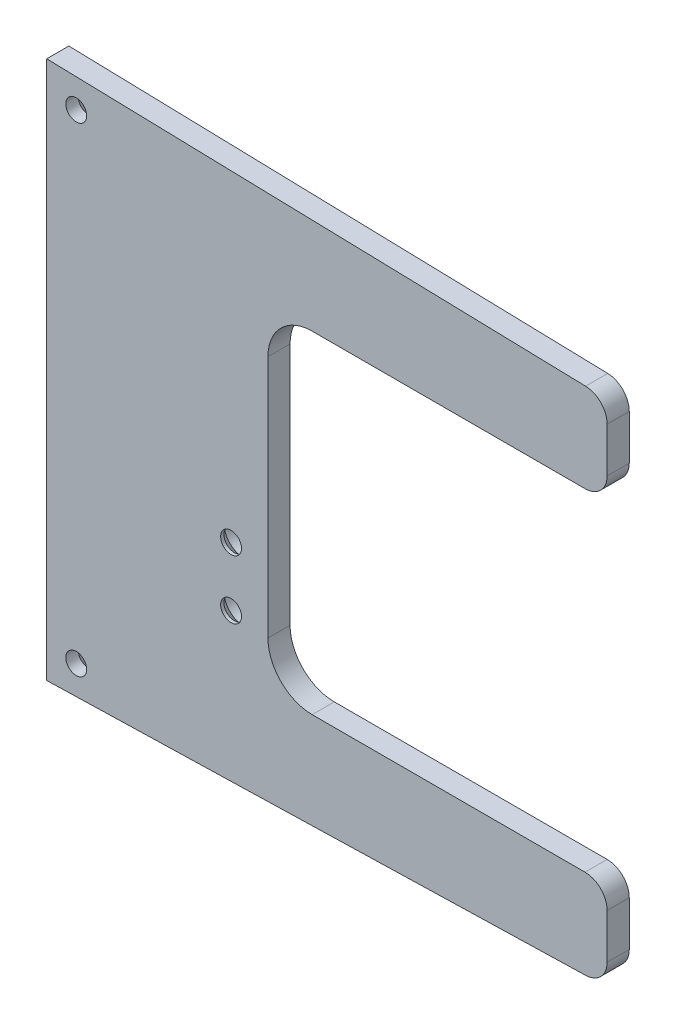
ISO-10303-21;
HEADER;
FILE_DESCRIPTION(('STEP AP214'),'2;1');
FILE_NAME('part.step','',(''),(''),'','','');
FILE_SCHEMA(('AUTOMOTIVE_DESIGN { 1 0 10303 214 1 1 1 1 }'));
ENDSEC;
DATA;
#1=APPLICATION_CONTEXT('core data for automotive mechanical design processes');
#2=APPLICATION_PROTOCOL_DEFINITION('international standard','automotive_design',2000,#1);
#3=PRODUCT_CONTEXT('',#1,'mechanical');
#4=PRODUCT('Part','Part','',(#3));
#5=PRODUCT_RELATED_PRODUCT_CATEGORY('part','',(#4));
#6=PRODUCT_DEFINITION_FORMATION('','',#4);
#7=PRODUCT_DEFINITION_CONTEXT('part definition',#1,'design');
#8=PRODUCT_DEFINITION('design','',#6,#7);
#9=PRODUCT_DEFINITION_SHAPE('','',#8);
#10=(LENGTH_UNIT() NAMED_UNIT(*) SI_UNIT(.MILLI.,.METRE.));
#11=(NAMED_UNIT(*) PLANE_ANGLE_UNIT() SI_UNIT($,.RADIAN.));
#12=(NAMED_UNIT(*) SI_UNIT($,.STERADIAN.) SOLID_ANGLE_UNIT());
#13=UNCERTAINTY_MEASURE_WITH_UNIT(LENGTH_MEASURE(1.E-05),#10,'distance_accuracy_value','');
#14=(GEOMETRIC_REPRESENTATION_CONTEXT(3) GLOBAL_UNCERTAINTY_ASSIGNED_CONTEXT((#13)) GLOBAL_UNIT_ASSIGNED_CONTEXT((#10,
#11,#12)) REPRESENTATION_CONTEXT('',''));
#15=CARTESIAN_POINT('',(0.,0.,0.));
#16=DIRECTION('',(0.,0.,1.));
#17=DIRECTION('',(1.,0.,0.));
#18=AXIS2_PLACEMENT_3D('',#15,#16,#17);
#19=CARTESIAN_POINT('',(-47.625,115.91925,-9.525));
#20=DIRECTION('',(1.,0.,0.));
#21=DIRECTION('',(0.,1.,0.));
#22=AXIS2_PLACEMENT_3D('',#19,#20,#21);
#23=PLANE('',#22);
#24=DIRECTION('',(0.,-1.,0.));
#25=VECTOR('',#24,1.);
#26=CARTESIAN_POINT('',(-47.625,115.91925,0.));
#27=LINE('',#26,#25);
#28=CARTESIAN_POINT('',(-47.625,115.91925,0.));
#29=VERTEX_POINT('',#28);
#30=CARTESIAN_POINT('',(-47.625,-115.91925,0.));
#31=VERTEX_POINT('',#30);
#32=EDGE_CURVE('E167',#29,#31,#27,.T.);
#33=ORIENTED_EDGE('',*,*,#32,.F.);
#34=DIRECTION('',(0.,0.,1.));
#35=VECTOR('',#34,1.);
#36=CARTESIAN_POINT('',(-47.625,115.91925,-9.525));
#37=LINE('',#36,#35);
#38=CARTESIAN_POINT('',(-47.625,115.91925,-9.525));
#39=VERTEX_POINT('',#38);
#40=EDGE_CURVE('E158',#39,#29,#37,.T.);
#41=ORIENTED_EDGE('',*,*,#40,.F.);
#42=DIRECTION('',(0.,-1.,0.));
#43=VECTOR('',#42,1.);
#44=CARTESIAN_POINT('',(-47.625,115.91925,-9.525));
#45=LINE('',#44,#43);
#46=CARTESIAN_POINT('',(-47.625,-115.91925,-9.525));
#47=VERTEX_POINT('',#46);
#48=EDGE_CURVE('E141',#39,#47,#45,.T.);
#49=ORIENTED_EDGE('',*,*,#48,.T.);
#50=DIRECTION('',(0.,0.,1.));
#51=VECTOR('',#50,1.);
#52=CARTESIAN_POINT('',(-47.625,-115.91925,-9.525));
#53=LINE('',#52,#51);
#54=EDGE_CURVE('E151',#47,#31,#53,.T.);
#55=ORIENTED_EDGE('',*,*,#54,.T.);
#56=EDGE_LOOP('',(#33,#41,#49,#55));
#57=FACE_BOUND('',#56,.T.);
#58=ADVANCED_FACE('F36',(#57),#23,.F.);
#59=CARTESIAN_POINT('',(47.625,115.91925,-9.525));
#60=DIRECTION('',(-1.,0.,0.));
#61=DIRECTION('',(0.,-1.,0.));
#62=AXIS2_PLACEMENT_3D('',#59,#60,#61);
#63=PLANE('',#62);
#64=DIRECTION('',(0.,1.,0.));
#65=VECTOR('',#64,1.);
#66=CARTESIAN_POINT('',(47.625,115.91925,-9.525));
#67=LINE('',#66,#65);
#68=CARTESIAN_POINT('',(47.625,-52.4505871253568,-9.525));
#69=VERTEX_POINT('',#68);
#70=CARTESIAN_POINT('',(47.625,52.4505871253569,-9.525));
#71=VERTEX_POINT('',#70);
#72=EDGE_CURVE('E161',#69,#71,#67,.T.);
#73=ORIENTED_EDGE('',*,*,#72,.T.);
#74=DIRECTION('',(0.,0.,-1.));
#75=VECTOR('',#74,1.);
#76=CARTESIAN_POINT('',(47.625,52.4505871253569,-9.525));
#77=LINE('',#76,#75);
#78=CARTESIAN_POINT('',(47.625,52.4505871253569,0.));
#79=VERTEX_POINT('',#78);
#80=EDGE_CURVE('E214',#79,#71,#77,.T.);
#81=ORIENTED_EDGE('',*,*,#80,.F.);
#82=DIRECTION('',(0.,1.,0.));
#83=VECTOR('',#82,1.);
#84=CARTESIAN_POINT('',(47.625,115.91925,0.));
#85=LINE('',#84,#83);
#86=CARTESIAN_POINT('',(47.625,-52.4505871253568,0.));
#87=VERTEX_POINT('',#86);
#88=EDGE_CURVE('E162',#87,#79,#85,.T.);
#89=ORIENTED_EDGE('',*,*,#88,.F.);
#90=DIRECTION('',(0.,0.,-1.));
#91=VECTOR('',#90,1.);
#92=CARTESIAN_POINT('',(47.625,-52.4505871253569,-9.525));
#93=LINE('',#92,#91);
#94=EDGE_CURVE('E217',#69,#87,#93,.F.);
#95=ORIENTED_EDGE('',*,*,#94,.F.);
#96=EDGE_LOOP('',(#73,#81,#89,#95));
#97=FACE_BOUND('',#96,.T.);
#98=ADVANCED_FACE('F308',(#97),#63,.F.);
#99=CARTESIAN_POINT('',(-47.625,-115.91925,-9.525));
#100=DIRECTION('',(0.,0.,-1.));
#101=DIRECTION('',(1.,0.,0.));
#102=AXIS2_PLACEMENT_3D('',#99,#100,#101);
#103=PLANE('',#102);
#104=DIRECTION('',(-0.999657324975558,-0.0261769483078661,0.));
#105=VECTOR('',#104,1.);
#106=CARTESIAN_POINT('',(47.625,-113.425040970536,-9.525));
#107=LINE('',#106,#105);
#108=CARTESIAN_POINT('',(184.399335432632,-109.84347895022,-9.525));
#109=VERTEX_POINT('',#108);
#110=EDGE_CURVE('E135',#109,#47,#107,.T.);
#111=ORIENTED_EDGE('',*,*,#110,.T.);
#112=ORIENTED_EDGE('',*,*,#48,.F.);
#113=DIRECTION('',(0.999657324975557,-0.026176948307866,0.));
#114=VECTOR('',#113,1.);
#115=CARTESIAN_POINT('',(-47.625,115.91925,-9.525));
#116=LINE('',#115,#114);
#117=CARTESIAN_POINT('',(184.399335432632,109.84347895022,-9.525));
#118=VERTEX_POINT('',#117);
#119=EDGE_CURVE('E147',#39,#118,#116,.T.);
#120=ORIENTED_EDGE('',*,*,#119,.T.);
#121=CARTESIAN_POINT('',(184.15,100.321742929828,-9.52500000000001));
#122=DIRECTION('',(0.,0.,1.));
#123=DIRECTION('',(1.,0.,0.));
#124=AXIS2_PLACEMENT_3D('',#121,#122,#123);
#125=CIRCLE('',#124,9.525);
#126=CARTESIAN_POINT('',(193.675,100.321742929828,-9.525));
#127=VERTEX_POINT('',#126);
#128=EDGE_CURVE('E176',#127,#118,#125,.T.);
#129=ORIENTED_EDGE('',*,*,#128,.F.);
#130=DIRECTION('',(0.,1.,0.));
#131=VECTOR('',#130,1.);
#132=CARTESIAN_POINT('',(193.675,109.600587125357,-9.525));
#133=LINE('',#132,#131);
#134=CARTESIAN_POINT('',(193.675,81.0255871253569,-9.525));
#135=VERTEX_POINT('',#134);
#136=EDGE_CURVE('E231',#135,#127,#133,.T.);
#137=ORIENTED_EDGE('',*,*,#136,.F.);
#138=CARTESIAN_POINT('',(184.15,81.0255871253569,-9.52500000000001));
#139=DIRECTION('',(0.,0.,1.));
#140=DIRECTION('',(1.,0.,0.));
#141=AXIS2_PLACEMENT_3D('',#138,#139,#140);
#142=CIRCLE('',#141,9.525);
#143=CARTESIAN_POINT('',(184.15,71.5005871253569,-9.525));
#144=VERTEX_POINT('',#143);
#145=EDGE_CURVE('E179',#144,#135,#142,.T.);
#146=ORIENTED_EDGE('',*,*,#145,.F.);
#147=DIRECTION('',(1.,0.,0.));
#148=VECTOR('',#147,1.);
#149=CARTESIAN_POINT('',(193.675,71.5005871253569,-9.525));
#150=LINE('',#149,#148);
#151=CARTESIAN_POINT('',(66.675,71.5005871253569,-9.525));
#152=VERTEX_POINT('',#151);
#153=EDGE_CURVE('E229',#152,#144,#150,.T.);
#154=ORIENTED_EDGE('',*,*,#153,.F.);
#155=CARTESIAN_POINT('',(66.675,52.4505871253569,-9.525));
#156=DIRECTION('',(0.,0.,1.));
#157=DIRECTION('',(1.,0.,0.));
#158=AXIS2_PLACEMENT_3D('',#155,#156,#157);
#159=CIRCLE('',#158,19.05);
#160=EDGE_CURVE('E44',#71,#152,#159,.F.);
#161=ORIENTED_EDGE('',*,*,#160,.F.);
#162=ORIENTED_EDGE('',*,*,#72,.F.);
#163=CARTESIAN_POINT('',(66.675,-52.4505871253569,-9.52500000000001));
#164=DIRECTION('',(0.,0.,1.));
#165=DIRECTION('',(1.,0.,0.));
#166=AXIS2_PLACEMENT_3D('',#163,#164,#165);
#167=CIRCLE('',#166,19.05);
#168=CARTESIAN_POINT('',(66.675,-71.5005871253569,-9.525));
#169=VERTEX_POINT('',#168);
#170=EDGE_CURVE('E221',#169,#69,#167,.F.);
#171=ORIENTED_EDGE('',*,*,#170,.F.);
#172=DIRECTION('',(-1.,0.,0.));
#173=VECTOR('',#172,1.);
#174=CARTESIAN_POINT('',(47.625,-71.5005871253569,-9.525));
#175=LINE('',#174,#173);
#176=CARTESIAN_POINT('',(184.15,-71.5005871253569,-9.525));
#177=VERTEX_POINT('',#176);
#178=EDGE_CURVE('E348',#177,#169,#175,.T.);
#179=ORIENTED_EDGE('',*,*,#178,.F.);
#180=CARTESIAN_POINT('',(184.15,-81.0255871253569,-9.52500000000001));
#181=DIRECTION('',(0.,0.,1.));
#182=DIRECTION('',(1.,0.,0.));
#183=AXIS2_PLACEMENT_3D('',#180,#181,#182);
#184=CIRCLE('',#183,9.525);
#185=CARTESIAN_POINT('',(193.675,-81.0255871253569,-9.525));
#186=VERTEX_POINT('',#185);
#187=EDGE_CURVE('E182',#186,#177,#184,.T.);
#188=ORIENTED_EDGE('',*,*,#187,.F.);
#189=DIRECTION('',(0.,1.,0.));
#190=VECTOR('',#189,1.);
#191=CARTESIAN_POINT('',(193.675,-71.5005871253569,-9.525));
#192=LINE('',#191,#190);
#193=CARTESIAN_POINT('',(193.675,-100.321742929828,-9.525));
#194=VERTEX_POINT('',#193);
#195=EDGE_CURVE('E351',#194,#186,#192,.T.);
#196=ORIENTED_EDGE('',*,*,#195,.F.);
#197=CARTESIAN_POINT('',(184.15,-100.321742929828,-9.525));
#198=DIRECTION('',(0.,0.,1.));
#199=DIRECTION('',(1.,0.,0.));
#200=AXIS2_PLACEMENT_3D('',#197,#198,#199);
#201=CIRCLE('',#200,9.525);
#202=EDGE_CURVE('E145',#109,#194,#201,.T.);
#203=ORIENTED_EDGE('',*,*,#202,.F.);
#204=EDGE_LOOP('',(#111,#112,#120,#129,#137,#146,#154,#161,#162,#171,#179,#188,#196,#203));
#205=FACE_BOUND('',#204,.T.);
#206=CARTESIAN_POINT('',(-34.925,103.21925,-9.525));
#207=DIRECTION('',(0.,0.,1.));
#208=DIRECTION('',(1.,0.,0.));
#209=AXIS2_PLACEMENT_3D('',#206,#207,#208);
#210=CIRCLE('',#209,8.65);
#211=CARTESIAN_POINT('',(-26.275,103.21925,-9.525));
#212=VERTEX_POINT('',#211);
#213=EDGE_CURVE('E249',#212,#212,#210,.T.);
#214=ORIENTED_EDGE('',*,*,#213,.T.);
#215=EDGE_LOOP('',(#214));
#216=FACE_BOUND('',#215,.T.);
#217=CARTESIAN_POINT('',(-34.925,-103.21925,-9.525));
#218=DIRECTION('',(0.,0.,1.));
#219=DIRECTION('',(1.,0.,0.));
#220=AXIS2_PLACEMENT_3D('',#217,#218,#219);
#221=CIRCLE('',#220,8.65);
#222=CARTESIAN_POINT('',(-26.275,-103.21925,-9.525));
#223=VERTEX_POINT('',#222);
#224=EDGE_CURVE('E258',#223,#223,#221,.T.);
#225=ORIENTED_EDGE('',*,*,#224,.T.);
#226=EDGE_LOOP('',(#225));
#227=FACE_BOUND('',#226,.T.);
#228=CARTESIAN_POINT('',(31.75,-50.15865,-9.525));
#229=DIRECTION('',(0.,0.,1.));
#230=DIRECTION('',(1.,0.,0.));
#231=AXIS2_PLACEMENT_3D('',#228,#229,#230);
#232=CIRCLE('',#231,8.65);
#233=CARTESIAN_POINT('',(40.4,-50.15865,-9.525));
#234=VERTEX_POINT('',#233);
#235=EDGE_CURVE('E276',#234,#234,#232,.T.);
#236=ORIENTED_EDGE('',*,*,#235,.T.);
#237=EDGE_LOOP('',(#236));
#238=FACE_BOUND('',#237,.T.);
#239=CARTESIAN_POINT('',(31.75,-24.75865,-9.525));
#240=DIRECTION('',(0.,0.,1.));
#241=DIRECTION('',(1.,0.,0.));
#242=AXIS2_PLACEMENT_3D('',#239,#240,#241);
#243=CIRCLE('',#242,8.65);
#244=CARTESIAN_POINT('',(40.4,-24.75865,-9.525));
#245=VERTEX_POINT('',#244);
#246=EDGE_CURVE('E170',#245,#245,#243,.T.);
#247=ORIENTED_EDGE('',*,*,#246,.T.);
#248=EDGE_LOOP('',(#247));
#249=FACE_BOUND('',#248,.T.);
#250=ADVANCED_FACE('F137',(#205,#216,#227,#238,#249),#103,.T.);
#251=CARTESIAN_POINT('',(-47.625,-115.91925,0.));
#252=DIRECTION('',(0.,0.,-1.));
#253=DIRECTION('',(1.,0.,0.));
#254=AXIS2_PLACEMENT_3D('',#251,#252,#253);
#255=PLANE('',#254);
#256=CARTESIAN_POINT('',(-34.925,103.21925,0.));
#257=DIRECTION('',(0.,0.,1.));
#258=DIRECTION('',(1.,0.,0.));
#259=AXIS2_PLACEMENT_3D('',#256,#257,#258);
#260=CIRCLE('',#259,4.49999999999999);
#261=CARTESIAN_POINT('',(-30.425,103.21925,0.));
#262=VERTEX_POINT('',#261);
#263=EDGE_CURVE('E255',#262,#262,#260,.T.);
#264=ORIENTED_EDGE('',*,*,#263,.F.);
#265=EDGE_LOOP('',(#264));
#266=FACE_BOUND('',#265,.T.);
#267=CARTESIAN_POINT('',(-34.925,-103.21925,0.));
#268=DIRECTION('',(0.,0.,1.));
#269=DIRECTION('',(1.,0.,0.));
#270=AXIS2_PLACEMENT_3D('',#267,#268,#269);
#271=CIRCLE('',#270,4.49999999999999);
#272=CARTESIAN_POINT('',(-30.425,-103.21925,0.));
#273=VERTEX_POINT('',#272);
#274=EDGE_CURVE('E264',#273,#273,#271,.T.);
#275=ORIENTED_EDGE('',*,*,#274,.F.);
#276=EDGE_LOOP('',(#275));
#277=FACE_BOUND('',#276,.T.);
#278=CARTESIAN_POINT('',(31.75,-50.15865,0.));
#279=DIRECTION('',(0.,0.,1.));
#280=DIRECTION('',(1.,0.,0.));
#281=AXIS2_PLACEMENT_3D('',#278,#279,#280);
#282=CIRCLE('',#281,4.5);
#283=CARTESIAN_POINT('',(36.25,-50.15865,0.));
#284=VERTEX_POINT('',#283);
#285=EDGE_CURVE('E267',#284,#284,#282,.T.);
#286=ORIENTED_EDGE('',*,*,#285,.F.);
#287=EDGE_LOOP('',(#286));
#288=FACE_BOUND('',#287,.T.);
#289=CARTESIAN_POINT('',(31.75,-24.75865,0.));
#290=DIRECTION('',(0.,0.,1.));
#291=DIRECTION('',(1.,0.,0.));
#292=AXIS2_PLACEMENT_3D('',#289,#290,#291);
#293=CIRCLE('',#292,4.5);
#294=CARTESIAN_POINT('',(36.25,-24.75865,0.));
#295=VERTEX_POINT('',#294);
#296=EDGE_CURVE('E279',#295,#295,#293,.T.);
#297=ORIENTED_EDGE('',*,*,#296,.F.);
#298=EDGE_LOOP('',(#297));
#299=FACE_BOUND('',#298,.T.);
#300=DIRECTION('',(0.,-1.,0.));
#301=VECTOR('',#300,1.);
#302=CARTESIAN_POINT('',(193.675,-71.5005871253569,0.));
#303=LINE('',#302,#301);
#304=CARTESIAN_POINT('',(193.675,-81.0255871253569,0.));
#305=VERTEX_POINT('',#304);
#306=CARTESIAN_POINT('',(193.675,-100.321742929828,0.));
#307=VERTEX_POINT('',#306);
#308=EDGE_CURVE('E238',#305,#307,#303,.T.);
#309=ORIENTED_EDGE('',*,*,#308,.F.);
#310=CARTESIAN_POINT('',(184.15,-81.0255871253569,0.));
#311=DIRECTION('',(0.,0.,1.));
#312=DIRECTION('',(1.,0.,0.));
#313=AXIS2_PLACEMENT_3D('',#310,#311,#312);
#314=CIRCLE('',#313,9.525);
#315=CARTESIAN_POINT('',(184.15,-71.5005871253569,0.));
#316=VERTEX_POINT('',#315);
#317=EDGE_CURVE('E196',#316,#305,#314,.F.);
#318=ORIENTED_EDGE('',*,*,#317,.F.);
#319=DIRECTION('',(1.,0.,0.));
#320=VECTOR('',#319,1.);
#321=CARTESIAN_POINT('',(47.625,-71.5005871253569,0.));
#322=LINE('',#321,#320);
#323=CARTESIAN_POINT('',(66.675,-71.5005871253569,0.));
#324=VERTEX_POINT('',#323);
#325=EDGE_CURVE('E232',#324,#316,#322,.T.);
#326=ORIENTED_EDGE('',*,*,#325,.F.);
#327=CARTESIAN_POINT('',(66.675,-52.4505871253569,0.));
#328=DIRECTION('',(0.,0.,1.));
#329=DIRECTION('',(1.,0.,0.));
#330=AXIS2_PLACEMENT_3D('',#327,#328,#329);
#331=CIRCLE('',#330,19.05);
#332=EDGE_CURVE('E223',#87,#324,#331,.T.);
#333=ORIENTED_EDGE('',*,*,#332,.F.);
#334=ORIENTED_EDGE('',*,*,#88,.T.);
#335=CARTESIAN_POINT('',(66.675,52.4505871253569,0.));
#336=DIRECTION('',(0.,0.,1.));
#337=DIRECTION('',(1.,0.,0.));
#338=AXIS2_PLACEMENT_3D('',#335,#336,#337);
#339=CIRCLE('',#338,19.05);
#340=CARTESIAN_POINT('',(66.675,71.5005871253569,0.));
#341=VERTEX_POINT('',#340);
#342=EDGE_CURVE('E11',#341,#79,#339,.T.);
#343=ORIENTED_EDGE('',*,*,#342,.F.);
#344=DIRECTION('',(-1.,0.,0.));
#345=VECTOR('',#344,1.);
#346=CARTESIAN_POINT('',(193.675,71.5005871253569,0.));
#347=LINE('',#346,#345);
#348=CARTESIAN_POINT('',(184.15,71.5005871253569,0.));
#349=VERTEX_POINT('',#348);
#350=EDGE_CURVE('E243',#349,#341,#347,.T.);
#351=ORIENTED_EDGE('',*,*,#350,.F.);
#352=CARTESIAN_POINT('',(184.15,81.0255871253569,0.));
#353=DIRECTION('',(0.,0.,1.));
#354=DIRECTION('',(1.,0.,0.));
#355=AXIS2_PLACEMENT_3D('',#352,#353,#354);
#356=CIRCLE('',#355,9.525);
#357=CARTESIAN_POINT('',(193.675,81.0255871253569,0.));
#358=VERTEX_POINT('',#357);
#359=EDGE_CURVE('E193',#358,#349,#356,.F.);
#360=ORIENTED_EDGE('',*,*,#359,.F.);
#361=DIRECTION('',(0.,-1.,0.));
#362=VECTOR('',#361,1.);
#363=CARTESIAN_POINT('',(193.675,109.600587125357,0.));
#364=LINE('',#363,#362);
#365=CARTESIAN_POINT('',(193.675,100.321742929828,0.));
#366=VERTEX_POINT('',#365);
#367=EDGE_CURVE('E235',#366,#358,#364,.T.);
#368=ORIENTED_EDGE('',*,*,#367,.F.);
#369=CARTESIAN_POINT('',(184.15,100.321742929828,0.));
#370=DIRECTION('',(0.,0.,1.));
#371=DIRECTION('',(1.,0.,0.));
#372=AXIS2_PLACEMENT_3D('',#369,#370,#371);
#373=CIRCLE('',#372,9.525);
#374=CARTESIAN_POINT('',(184.399335432632,109.84347895022,0.));
#375=VERTEX_POINT('',#374);
#376=EDGE_CURVE('E190',#375,#366,#373,.F.);
#377=ORIENTED_EDGE('',*,*,#376,.F.);
#378=DIRECTION('',(-0.999657324975558,0.026176948307866,0.));
#379=VECTOR('',#378,1.);
#380=CARTESIAN_POINT('',(-47.625,115.91925,0.));
#381=LINE('',#380,#379);
#382=EDGE_CURVE('E247',#375,#29,#381,.T.);
#383=ORIENTED_EDGE('',*,*,#382,.T.);
#384=ORIENTED_EDGE('',*,*,#32,.T.);
#385=DIRECTION('',(0.999657324975558,0.0261769483078661,0.));
#386=VECTOR('',#385,1.);
#387=CARTESIAN_POINT('',(47.625,-113.425040970536,0.));
#388=LINE('',#387,#386);
#389=CARTESIAN_POINT('',(184.399335432632,-109.84347895022,0.));
#390=VERTEX_POINT('',#389);
#391=EDGE_CURVE('E148',#31,#390,#388,.T.);
#392=ORIENTED_EDGE('',*,*,#391,.T.);
#393=CARTESIAN_POINT('',(184.15,-100.321742929828,0.));
#394=DIRECTION('',(0.,0.,1.));
#395=DIRECTION('',(1.,0.,0.));
#396=AXIS2_PLACEMENT_3D('',#393,#394,#395);
#397=CIRCLE('',#396,9.525);
#398=EDGE_CURVE('E199',#307,#390,#397,.F.);
#399=ORIENTED_EDGE('',*,*,#398,.F.);
#400=EDGE_LOOP('',(#309,#318,#326,#333,#334,#343,#351,#360,#368,#377,#383,#384,#392,#399));
#401=FACE_BOUND('',#400,.T.);
#402=ADVANCED_FACE('F295',(#266,#277,#288,#299,#401),#255,.F.);
#403=CARTESIAN_POINT('',(31.75,-24.75865,-9.525));
#404=DIRECTION('',(0.,0.,-1.));
#405=DIRECTION('',(1.,0.,0.));
#406=AXIS2_PLACEMENT_3D('',#403,#404,#405);
#407=CYLINDRICAL_SURFACE('',#406,8.65);
#408=CARTESIAN_POINT('',(31.75,-24.75865,-5.5626));
#409=DIRECTION('',(0.,0.,1.));
#410=DIRECTION('',(1.,0.,0.));
#411=AXIS2_PLACEMENT_3D('',#408,#409,#410);
#412=CIRCLE('',#411,8.65);
#413=CARTESIAN_POINT('',(40.4,-24.75865,-5.5626));
#414=VERTEX_POINT('',#413);
#415=EDGE_CURVE('E284',#414,#414,#412,.T.);
#416=ORIENTED_EDGE('',*,*,#415,.T.);
#417=EDGE_LOOP('',(#416));
#418=FACE_BOUND('',#417,.T.);
#419=ORIENTED_EDGE('',*,*,#246,.F.);
#420=EDGE_LOOP('',(#419));
#421=FACE_BOUND('',#420,.T.);
#422=ADVANCED_FACE('F292',(#418,#421),#407,.F.);
#423=CARTESIAN_POINT('',(31.75,-24.75865,-5.5626));
#424=DIRECTION('',(0.,0.,-1.));
#425=DIRECTION('',(1.,0.,0.));
#426=AXIS2_PLACEMENT_3D('',#423,#424,#425);
#427=CONICAL_SURFACE('',#426,8.65,0.785398163397449);
#428=CARTESIAN_POINT('',(31.75,-24.75865,-1.41260000000001));
#429=DIRECTION('',(0.,0.,1.));
#430=DIRECTION('',(1.,0.,0.));
#431=AXIS2_PLACEMENT_3D('',#428,#429,#430);
#432=CIRCLE('',#431,4.5);
#433=CARTESIAN_POINT('',(36.25,-24.75865,-1.41260000000001));
#434=VERTEX_POINT('',#433);
#435=EDGE_CURVE('E282',#434,#434,#432,.T.);
#436=ORIENTED_EDGE('',*,*,#435,.T.);
#437=EDGE_LOOP('',(#436));
#438=FACE_BOUND('',#437,.T.);
#439=ORIENTED_EDGE('',*,*,#415,.F.);
#440=EDGE_LOOP('',(#439));
#441=FACE_BOUND('',#440,.T.);
#442=ADVANCED_FACE('F294',(#438,#441),#427,.F.);
#443=CARTESIAN_POINT('',(31.75,-24.75865,-9.525));
#444=DIRECTION('',(0.,0.,-1.));
#445=DIRECTION('',(1.,0.,0.));
#446=AXIS2_PLACEMENT_3D('',#443,#444,#445);
#447=CYLINDRICAL_SURFACE('',#446,4.5);
#448=ORIENTED_EDGE('',*,*,#296,.T.);
#449=EDGE_LOOP('',(#448));
#450=FACE_BOUND('',#449,.T.);
#451=ORIENTED_EDGE('',*,*,#435,.F.);
#452=EDGE_LOOP('',(#451));
#453=FACE_BOUND('',#452,.T.);
#454=ADVANCED_FACE('F301',(#450,#453),#447,.F.);
#455=CARTESIAN_POINT('',(31.75,-50.15865,-9.525));
#456=DIRECTION('',(0.,0.,-1.));
#457=DIRECTION('',(1.,0.,0.));
#458=AXIS2_PLACEMENT_3D('',#455,#456,#457);
#459=CYLINDRICAL_SURFACE('',#458,8.65);
#460=CARTESIAN_POINT('',(31.75,-50.15865,-5.5626));
#461=DIRECTION('',(0.,0.,1.));
#462=DIRECTION('',(1.,0.,0.));
#463=AXIS2_PLACEMENT_3D('',#460,#461,#462);
#464=CIRCLE('',#463,8.65);
#465=CARTESIAN_POINT('',(40.4,-50.15865,-5.5626));
#466=VERTEX_POINT('',#465);
#467=EDGE_CURVE('E273',#466,#466,#464,.T.);
#468=ORIENTED_EDGE('',*,*,#467,.T.);
#469=EDGE_LOOP('',(#468));
#470=FACE_BOUND('',#469,.T.);
#471=ORIENTED_EDGE('',*,*,#235,.F.);
#472=EDGE_LOOP('',(#471));
#473=FACE_BOUND('',#472,.T.);
#474=ADVANCED_FACE('F409',(#470,#473),#459,.F.);
#475=CARTESIAN_POINT('',(31.75,-50.15865,-5.5626));
#476=DIRECTION('',(0.,0.,-1.));
#477=DIRECTION('',(1.,0.,0.));
#478=AXIS2_PLACEMENT_3D('',#475,#476,#477);
#479=CONICAL_SURFACE('',#478,8.65,0.785398163397449);
#480=CARTESIAN_POINT('',(31.75,-50.15865,-1.41260000000001));
#481=DIRECTION('',(0.,0.,1.));
#482=DIRECTION('',(1.,0.,0.));
#483=AXIS2_PLACEMENT_3D('',#480,#481,#482);
#484=CIRCLE('',#483,4.5);
#485=CARTESIAN_POINT('',(36.25,-50.15865,-1.41260000000001));
#486=VERTEX_POINT('',#485);
#487=EDGE_CURVE('E270',#486,#486,#484,.T.);
#488=ORIENTED_EDGE('',*,*,#487,.T.);
#489=EDGE_LOOP('',(#488));
#490=FACE_BOUND('',#489,.T.);
#491=ORIENTED_EDGE('',*,*,#467,.F.);
#492=EDGE_LOOP('',(#491));
#493=FACE_BOUND('',#492,.T.);
#494=ADVANCED_FACE('F405',(#490,#493),#479,.F.);
#495=CARTESIAN_POINT('',(31.75,-50.15865,-9.525));
#496=DIRECTION('',(0.,0.,-1.));
#497=DIRECTION('',(1.,0.,0.));
#498=AXIS2_PLACEMENT_3D('',#495,#496,#497);
#499=CYLINDRICAL_SURFACE('',#498,4.5);
#500=ORIENTED_EDGE('',*,*,#285,.T.);
#501=EDGE_LOOP('',(#500));
#502=FACE_BOUND('',#501,.T.);
#503=ORIENTED_EDGE('',*,*,#487,.F.);
#504=EDGE_LOOP('',(#503));
#505=FACE_BOUND('',#504,.T.);
#506=ADVANCED_FACE('F401',(#502,#505),#499,.F.);
#507=CARTESIAN_POINT('',(-34.925,-103.21925,-9.525));
#508=DIRECTION('',(0.,0.,-1.));
#509=DIRECTION('',(1.,0.,0.));
#510=AXIS2_PLACEMENT_3D('',#507,#508,#509);
#511=CYLINDRICAL_SURFACE('',#510,4.49999999999999);
#512=ORIENTED_EDGE('',*,*,#274,.T.);
#513=EDGE_LOOP('',(#512));
#514=FACE_BOUND('',#513,.T.);
#515=CARTESIAN_POINT('',(-34.925,-103.21925,-5.375));
#516=DIRECTION('',(0.,0.,1.));
#517=DIRECTION('',(1.,0.,0.));
#518=AXIS2_PLACEMENT_3D('',#515,#516,#517);
#519=CIRCLE('',#518,4.5);
#520=CARTESIAN_POINT('',(-30.425,-103.21925,-5.375));
#521=VERTEX_POINT('',#520);
#522=EDGE_CURVE('E261',#521,#521,#519,.T.);
#523=ORIENTED_EDGE('',*,*,#522,.F.);
#524=EDGE_LOOP('',(#523));
#525=FACE_BOUND('',#524,.T.);
#526=ADVANCED_FACE('F397',(#514,#525),#511,.F.);
#527=CARTESIAN_POINT('',(-34.925,-103.21925,-9.525));
#528=DIRECTION('',(0.,0.,-1.));
#529=DIRECTION('',(1.,0.,0.));
#530=AXIS2_PLACEMENT_3D('',#527,#528,#529);
#531=CONICAL_SURFACE('',#530,8.65,0.785398163397448);
#532=ORIENTED_EDGE('',*,*,#522,.T.);
#533=EDGE_LOOP('',(#532));
#534=FACE_BOUND('',#533,.T.);
#535=ORIENTED_EDGE('',*,*,#224,.F.);
#536=EDGE_LOOP('',(#535));
#537=FACE_BOUND('',#536,.T.);
#538=ADVANCED_FACE('F393',(#534,#537),#531,.F.);
#539=CARTESIAN_POINT('',(-34.925,103.21925,-9.525));
#540=DIRECTION('',(0.,0.,-1.));
#541=DIRECTION('',(1.,0.,0.));
#542=AXIS2_PLACEMENT_3D('',#539,#540,#541);
#543=CYLINDRICAL_SURFACE('',#542,4.49999999999999);
#544=ORIENTED_EDGE('',*,*,#263,.T.);
#545=EDGE_LOOP('',(#544));
#546=FACE_BOUND('',#545,.T.);
#547=CARTESIAN_POINT('',(-34.925,103.21925,-5.375));
#548=DIRECTION('',(0.,0.,1.));
#549=DIRECTION('',(1.,0.,0.));
#550=AXIS2_PLACEMENT_3D('',#547,#548,#549);
#551=CIRCLE('',#550,4.5);
#552=CARTESIAN_POINT('',(-30.425,103.21925,-5.375));
#553=VERTEX_POINT('',#552);
#554=EDGE_CURVE('E252',#553,#553,#551,.T.);
#555=ORIENTED_EDGE('',*,*,#554,.F.);
#556=EDGE_LOOP('',(#555));
#557=FACE_BOUND('',#556,.T.);
#558=ADVANCED_FACE('F389',(#546,#557),#543,.F.);
#559=CARTESIAN_POINT('',(-34.925,103.21925,-9.525));
#560=DIRECTION('',(0.,0.,-1.));
#561=DIRECTION('',(1.,0.,0.));
#562=AXIS2_PLACEMENT_3D('',#559,#560,#561);
#563=CONICAL_SURFACE('',#562,8.65,0.785398163397448);
#564=ORIENTED_EDGE('',*,*,#554,.T.);
#565=EDGE_LOOP('',(#564));
#566=FACE_BOUND('',#565,.T.);
#567=ORIENTED_EDGE('',*,*,#213,.F.);
#568=EDGE_LOOP('',(#567));
#569=FACE_BOUND('',#568,.T.);
#570=ADVANCED_FACE('F386',(#566,#569),#563,.F.);
#571=CARTESIAN_POINT('',(-47.625,115.91925,0.00100000000000447));
#572=DIRECTION('',(-0.026176948307866,-0.999657324975557,0.));
#573=DIRECTION('',(0.999657324975558,-0.026176948307866,0.));
#574=AXIS2_PLACEMENT_3D('',#571,#572,#573);
#575=PLANE('',#574);
#576=ORIENTED_EDGE('',*,*,#119,.F.);
#577=ORIENTED_EDGE('',*,*,#40,.T.);
#578=ORIENTED_EDGE('',*,*,#382,.F.);
#579=DIRECTION('',(0.,0.,-1.));
#580=VECTOR('',#579,1.);
#581=CARTESIAN_POINT('',(184.399335432632,109.84347895022,0.));
#582=LINE('',#581,#580);
#583=EDGE_CURVE('E210',#118,#375,#582,.F.);
#584=ORIENTED_EDGE('',*,*,#583,.F.);
#585=EDGE_LOOP('',(#576,#577,#578,#584));
#586=FACE_BOUND('',#585,.T.);
#587=ADVANCED_FACE('F364',(#586),#575,.F.);
#588=CARTESIAN_POINT('',(47.625,-113.425040970536,0.00100000000000447));
#589=DIRECTION('',(-0.0261769483078661,0.999657324975557,0.));
#590=DIRECTION('',(-0.999657324975558,-0.0261769483078661,0.));
#591=AXIS2_PLACEMENT_3D('',#588,#589,#590);
#592=PLANE('',#591);
#593=ORIENTED_EDGE('',*,*,#391,.F.);
#594=ORIENTED_EDGE('',*,*,#54,.F.);
#595=ORIENTED_EDGE('',*,*,#110,.F.);
#596=DIRECTION('',(0.,0.,-1.));
#597=VECTOR('',#596,1.);
#598=CARTESIAN_POINT('',(184.399335432632,-109.84347895022,-9.525));
#599=LINE('',#598,#597);
#600=EDGE_CURVE('E157',#390,#109,#599,.T.);
#601=ORIENTED_EDGE('',*,*,#600,.F.);
#602=EDGE_LOOP('',(#593,#594,#595,#601));
#603=FACE_BOUND('',#602,.T.);
#604=ADVANCED_FACE('F152',(#603),#592,.F.);
#605=CARTESIAN_POINT('',(193.675,109.600587125357,151.948222530626));
#606=DIRECTION('',(1.,0.,0.));
#607=DIRECTION('',(0.,0.,1.));
#608=AXIS2_PLACEMENT_3D('',#605,#606,#607);
#609=PLANE('',#608);
#610=ORIENTED_EDGE('',*,*,#136,.T.);
#611=DIRECTION('',(0.,0.,-1.));
#612=VECTOR('',#611,1.);
#613=CARTESIAN_POINT('',(193.675,100.321742929828,-9.52500000000001));
#614=LINE('',#613,#612);
#615=EDGE_CURVE('E206',#366,#127,#614,.T.);
#616=ORIENTED_EDGE('',*,*,#615,.F.);
#617=ORIENTED_EDGE('',*,*,#367,.T.);
#618=DIRECTION('',(0.,0.,-1.));
#619=VECTOR('',#618,1.);
#620=CARTESIAN_POINT('',(193.675,81.0255871253569,151.948222530626));
#621=LINE('',#620,#619);
#622=EDGE_CURVE('E208',#135,#358,#621,.F.);
#623=ORIENTED_EDGE('',*,*,#622,.F.);
#624=EDGE_LOOP('',(#610,#616,#617,#623));
#625=FACE_BOUND('',#624,.T.);
#626=ADVANCED_FACE('F359',(#625),#609,.T.);
#627=CARTESIAN_POINT('',(193.675,71.5005871253569,151.948222530626));
#628=DIRECTION('',(0.,-1.,0.));
#629=DIRECTION('',(1.,0.,0.));
#630=AXIS2_PLACEMENT_3D('',#627,#628,#629);
#631=PLANE('',#630);
#632=ORIENTED_EDGE('',*,*,#153,.T.);
#633=DIRECTION('',(0.,0.,-1.));
#634=VECTOR('',#633,1.);
#635=CARTESIAN_POINT('',(184.15,71.5005871253569,151.948222530626));
#636=LINE('',#635,#634);
#637=EDGE_CURVE('E204',#349,#144,#636,.T.);
#638=ORIENTED_EDGE('',*,*,#637,.F.);
#639=ORIENTED_EDGE('',*,*,#350,.T.);
#640=DIRECTION('',(0.,0.,-1.));
#641=VECTOR('',#640,1.);
#642=CARTESIAN_POINT('',(66.675,71.5005871253569,151.948222530626));
#643=LINE('',#642,#641);
#644=EDGE_CURVE('E51',#152,#341,#643,.F.);
#645=ORIENTED_EDGE('',*,*,#644,.F.);
#646=EDGE_LOOP('',(#632,#638,#639,#645));
#647=FACE_BOUND('',#646,.T.);
#648=ADVANCED_FACE('F356',(#647),#631,.T.);
#649=CARTESIAN_POINT('',(47.625,-71.5005871253569,151.948222530626));
#650=DIRECTION('',(0.,1.,0.));
#651=DIRECTION('',(0.,0.,-1.));
#652=AXIS2_PLACEMENT_3D('',#649,#650,#651);
#653=PLANE('',#652);
#654=ORIENTED_EDGE('',*,*,#325,.T.);
#655=DIRECTION('',(0.,0.,-1.));
#656=VECTOR('',#655,1.);
#657=CARTESIAN_POINT('',(184.15,-71.5005871253569,151.948222530626));
#658=LINE('',#657,#656);
#659=EDGE_CURVE('E202',#177,#316,#658,.F.);
#660=ORIENTED_EDGE('',*,*,#659,.F.);
#661=ORIENTED_EDGE('',*,*,#178,.T.);
#662=DIRECTION('',(0.,0.,-1.));
#663=VECTOR('',#662,1.);
#664=CARTESIAN_POINT('',(66.675,-71.5005871253569,151.948222530626));
#665=LINE('',#664,#663);
#666=EDGE_CURVE('E212',#324,#169,#665,.T.);
#667=ORIENTED_EDGE('',*,*,#666,.F.);
#668=EDGE_LOOP('',(#654,#660,#661,#667));
#669=FACE_BOUND('',#668,.T.);
#670=ADVANCED_FACE('F346',(#669),#653,.T.);
#671=CARTESIAN_POINT('',(193.675,-71.5005871253569,151.948222530626));
#672=DIRECTION('',(1.,0.,0.));
#673=DIRECTION('',(0.,1.,0.));
#674=AXIS2_PLACEMENT_3D('',#671,#672,#673);
#675=PLANE('',#674);
#676=ORIENTED_EDGE('',*,*,#195,.T.);
#677=DIRECTION('',(0.,0.,-1.));
#678=VECTOR('',#677,1.);
#679=CARTESIAN_POINT('',(193.675,-81.0255871253569,151.948222530626));
#680=LINE('',#679,#678);
#681=EDGE_CURVE('E186',#305,#186,#680,.T.);
#682=ORIENTED_EDGE('',*,*,#681,.F.);
#683=ORIENTED_EDGE('',*,*,#308,.T.);
#684=DIRECTION('',(0.,0.,-1.));
#685=VECTOR('',#684,1.);
#686=CARTESIAN_POINT('',(193.675,-100.321742929828,0.));
#687=LINE('',#686,#685);
#688=EDGE_CURVE('E188',#194,#307,#687,.F.);
#689=ORIENTED_EDGE('',*,*,#688,.F.);
#690=EDGE_LOOP('',(#676,#682,#683,#689));
#691=FACE_BOUND('',#690,.T.);
#692=ADVANCED_FACE('F320',(#691),#675,.T.);
#693=CARTESIAN_POINT('',(184.15,-100.321742929828,0.00100000000000447));
#694=DIRECTION('',(0.,0.,1.));
#695=DIRECTION('',(-1.,0.,0.));
#696=AXIS2_PLACEMENT_3D('',#693,#694,#695);
#697=CYLINDRICAL_SURFACE('',#696,9.525);
#698=ORIENTED_EDGE('',*,*,#398,.T.);
#699=ORIENTED_EDGE('',*,*,#600,.T.);
#700=ORIENTED_EDGE('',*,*,#202,.T.);
#701=ORIENTED_EDGE('',*,*,#688,.T.);
#702=EDGE_LOOP('',(#698,#699,#700,#701));
#703=FACE_BOUND('',#702,.T.);
#704=ADVANCED_FACE('F316',(#703),#697,.T.);
#705=CARTESIAN_POINT('',(184.15,-81.0255871253569,151.948222530626));
#706=DIRECTION('',(0.,0.,-1.));
#707=DIRECTION('',(1.,0.,0.));
#708=AXIS2_PLACEMENT_3D('',#705,#706,#707);
#709=CYLINDRICAL_SURFACE('',#708,9.525);
#710=ORIENTED_EDGE('',*,*,#317,.T.);
#711=ORIENTED_EDGE('',*,*,#681,.T.);
#712=ORIENTED_EDGE('',*,*,#187,.T.);
#713=ORIENTED_EDGE('',*,*,#659,.T.);
#714=EDGE_LOOP('',(#710,#711,#712,#713));
#715=FACE_BOUND('',#714,.T.);
#716=ADVANCED_FACE('F319',(#715),#709,.T.);
#717=CARTESIAN_POINT('',(184.15,81.0255871253569,151.948222530626));
#718=DIRECTION('',(0.,0.,-1.));
#719=DIRECTION('',(1.,0.,0.));
#720=AXIS2_PLACEMENT_3D('',#717,#718,#719);
#721=CYLINDRICAL_SURFACE('',#720,9.525);
#722=ORIENTED_EDGE('',*,*,#359,.T.);
#723=ORIENTED_EDGE('',*,*,#637,.T.);
#724=ORIENTED_EDGE('',*,*,#145,.T.);
#725=ORIENTED_EDGE('',*,*,#622,.T.);
#726=EDGE_LOOP('',(#722,#723,#724,#725));
#727=FACE_BOUND('',#726,.T.);
#728=ADVANCED_FACE('F324',(#727),#721,.T.);
#729=CARTESIAN_POINT('',(184.15,100.321742929828,151.948222530626));
#730=DIRECTION('',(0.,0.,1.));
#731=DIRECTION('',(-1.,0.,0.));
#732=AXIS2_PLACEMENT_3D('',#729,#730,#731);
#733=CYLINDRICAL_SURFACE('',#732,9.525);
#734=ORIENTED_EDGE('',*,*,#376,.T.);
#735=ORIENTED_EDGE('',*,*,#615,.T.);
#736=ORIENTED_EDGE('',*,*,#128,.T.);
#737=ORIENTED_EDGE('',*,*,#583,.T.);
#738=EDGE_LOOP('',(#734,#735,#736,#737));
#739=FACE_BOUND('',#738,.T.);
#740=ADVANCED_FACE('F328',(#739),#733,.T.);
#741=CARTESIAN_POINT('',(66.675,-52.4505871253569,151.948222530626));
#742=DIRECTION('',(0.,0.,-1.));
#743=DIRECTION('',(1.,0.,0.));
#744=AXIS2_PLACEMENT_3D('',#741,#742,#743);
#745=CYLINDRICAL_SURFACE('',#744,19.05);
#746=ORIENTED_EDGE('',*,*,#332,.T.);
#747=ORIENTED_EDGE('',*,*,#666,.T.);
#748=ORIENTED_EDGE('',*,*,#170,.T.);
#749=ORIENTED_EDGE('',*,*,#94,.T.);
#750=EDGE_LOOP('',(#746,#747,#748,#749));
#751=FACE_BOUND('',#750,.T.);
#752=ADVANCED_FACE('F331',(#751),#745,.F.);
#753=CARTESIAN_POINT('',(66.675,52.4505871253569,-9.525));
#754=DIRECTION('',(0.,0.,-1.));
#755=DIRECTION('',(1.,0.,0.));
#756=AXIS2_PLACEMENT_3D('',#753,#754,#755);
#757=CYLINDRICAL_SURFACE('',#756,19.05);
#758=ORIENTED_EDGE('',*,*,#342,.T.);
#759=ORIENTED_EDGE('',*,*,#80,.T.);
#760=ORIENTED_EDGE('',*,*,#160,.T.);
#761=ORIENTED_EDGE('',*,*,#644,.T.);
#762=EDGE_LOOP('',(#758,#759,#760,#761));
#763=FACE_BOUND('',#762,.T.);
#764=ADVANCED_FACE('F38',(#763),#757,.F.);
#765=CLOSED_SHELL('',(#58,#98,#250,#402,#422,#442,#454,#474,#494,#506,#526,#538,#558,#570,#587,
#604,#626,#648,#670,#692,#704,#716,#728,#740,#752,#764));
#766=MANIFOLD_SOLID_BREP('B2',#765);
#767=ADVANCED_BREP_SHAPE_REPRESENTATION('',(#18,#766),#14);
#768=SHAPE_DEFINITION_REPRESENTATION(#9,#767);
ENDSEC;
END-ISO-10303-21;
